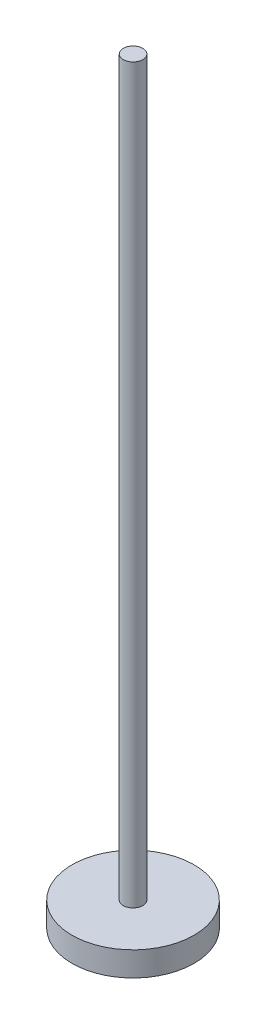
ISO-10303-21;
HEADER;
FILE_DESCRIPTION(('STEP AP214'),'2;1');
FILE_NAME('part.step','',(''),(''),'','','');
FILE_SCHEMA(('AUTOMOTIVE_DESIGN { 1 0 10303 214 1 1 1 1 }'));
ENDSEC;
DATA;
#1=APPLICATION_CONTEXT('core data for automotive mechanical design processes');
#2=APPLICATION_PROTOCOL_DEFINITION('international standard','automotive_design',2000,#1);
#3=PRODUCT_CONTEXT('',#1,'mechanical');
#4=PRODUCT('Part','Part','',(#3));
#5=PRODUCT_RELATED_PRODUCT_CATEGORY('part','',(#4));
#6=PRODUCT_DEFINITION_FORMATION('','',#4);
#7=PRODUCT_DEFINITION_CONTEXT('part definition',#1,'design');
#8=PRODUCT_DEFINITION('design','',#6,#7);
#9=PRODUCT_DEFINITION_SHAPE('','',#8);
#10=(LENGTH_UNIT() NAMED_UNIT(*) SI_UNIT(.MILLI.,.METRE.));
#11=(NAMED_UNIT(*) PLANE_ANGLE_UNIT() SI_UNIT($,.RADIAN.));
#12=(NAMED_UNIT(*) SI_UNIT($,.STERADIAN.) SOLID_ANGLE_UNIT());
#13=UNCERTAINTY_MEASURE_WITH_UNIT(LENGTH_MEASURE(1.E-05),#10,'distance_accuracy_value','');
#14=(GEOMETRIC_REPRESENTATION_CONTEXT(3) GLOBAL_UNCERTAINTY_ASSIGNED_CONTEXT((#13)) GLOBAL_UNIT_ASSIGNED_CONTEXT((#10,
#11,#12)) REPRESENTATION_CONTEXT('',''));
#15=CARTESIAN_POINT('',(0.,0.,0.));
#16=DIRECTION('',(0.,0.,1.));
#17=DIRECTION('',(1.,0.,0.));
#18=AXIS2_PLACEMENT_3D('',#15,#16,#17);
#19=CARTESIAN_POINT('',(4.00000000000568,300.,0.));
#20=DIRECTION('',(0.,1.,0.));
#21=DIRECTION('',(-1.,0.,0.));
#22=AXIS2_PLACEMENT_3D('',#19,#20,#21);
#23=PLANE('',#22);
#24=CARTESIAN_POINT('',(-1.02907469966573E-12,300.,0.));
#25=DIRECTION('',(0.,-1.,0.));
#26=DIRECTION('',(1.,0.,0.));
#27=AXIS2_PLACEMENT_3D('',#24,#25,#26);
#28=CIRCLE('',#27,4.00000000000671);
#29=CARTESIAN_POINT('',(4.00000000000568,300.,0.));
#30=VERTEX_POINT('',#29);
#31=EDGE_CURVE('E10',#30,#30,#28,.T.);
#32=ORIENTED_EDGE('',*,*,#31,.F.);
#33=EDGE_LOOP('',(#32));
#34=FACE_BOUND('',#33,.T.);
#35=ADVANCED_FACE('F39',(#34),#23,.T.);
#36=CARTESIAN_POINT('',(5.67706394844786E-12,-1655.00054086217,0.));
#37=DIRECTION('',(0.,-1.,0.));
#38=DIRECTION('',(1.,0.,0.));
#39=AXIS2_PLACEMENT_3D('',#36,#37,#38);
#40=CYLINDRICAL_SURFACE('',#39,4.00000000000319);
#41=ORIENTED_EDGE('',*,*,#31,.T.);
#42=EDGE_LOOP('',(#41));
#43=FACE_BOUND('',#42,.T.);
#44=CARTESIAN_POINT('',(0.,0.,0.));
#45=DIRECTION('',(0.,-1.,0.));
#46=DIRECTION('',(1.,0.,0.));
#47=AXIS2_PLACEMENT_3D('',#44,#45,#46);
#48=CIRCLE('',#47,3.99999999999967);
#49=CARTESIAN_POINT('',(3.99999999999967,0.,0.));
#50=VERTEX_POINT('',#49);
#51=EDGE_CURVE('E45',#50,#50,#48,.T.);
#52=ORIENTED_EDGE('',*,*,#51,.F.);
#53=EDGE_LOOP('',(#52));
#54=FACE_BOUND('',#53,.T.);
#55=ADVANCED_FACE('F71',(#43,#54),#40,.T.);
#56=CARTESIAN_POINT('',(3.99999999999967,0.,0.));
#57=DIRECTION('',(0.,1.,0.));
#58=DIRECTION('',(-1.,0.,0.));
#59=AXIS2_PLACEMENT_3D('',#56,#57,#58);
#60=PLANE('',#59);
#61=ORIENTED_EDGE('',*,*,#51,.T.);
#62=EDGE_LOOP('',(#61));
#63=FACE_BOUND('',#62,.T.);
#64=CARTESIAN_POINT('',(0.,0.,0.));
#65=DIRECTION('',(0.,-1.,0.));
#66=DIRECTION('',(1.,0.,0.));
#67=AXIS2_PLACEMENT_3D('',#64,#65,#66);
#68=CIRCLE('',#67,25.);
#69=CARTESIAN_POINT('',(25.,0.,0.));
#70=VERTEX_POINT('',#69);
#71=EDGE_CURVE('E49',#70,#70,#68,.T.);
#72=ORIENTED_EDGE('',*,*,#71,.F.);
#73=EDGE_LOOP('',(#72));
#74=FACE_BOUND('',#73,.T.);
#75=ADVANCED_FACE('F63',(#63,#74),#60,.T.);
#76=CARTESIAN_POINT('',(5.67706394844786E-12,-1655.00054086217,0.));
#77=DIRECTION('',(0.,-1.,0.));
#78=DIRECTION('',(1.,0.,0.));
#79=AXIS2_PLACEMENT_3D('',#76,#77,#78);
#80=CYLINDRICAL_SURFACE('',#79,25.);
#81=ORIENTED_EDGE('',*,*,#71,.T.);
#82=EDGE_LOOP('',(#81));
#83=FACE_BOUND('',#82,.T.);
#84=CARTESIAN_POINT('',(0.,-10.,0.));
#85=DIRECTION('',(0.,-1.,0.));
#86=DIRECTION('',(1.,0.,0.));
#87=AXIS2_PLACEMENT_3D('',#84,#85,#86);
#88=CIRCLE('',#87,25.);
#89=CARTESIAN_POINT('',(25.,-9.99999999999992,0.));
#90=VERTEX_POINT('',#89);
#91=EDGE_CURVE('E53',#90,#90,#88,.T.);
#92=ORIENTED_EDGE('',*,*,#91,.F.);
#93=EDGE_LOOP('',(#92));
#94=FACE_BOUND('',#93,.T.);
#95=ADVANCED_FACE('F61',(#83,#94),#80,.T.);
#96=CARTESIAN_POINT('',(25.,-9.99999999999996,0.));
#97=DIRECTION('',(0.,-1.,0.));
#98=DIRECTION('',(1.,0.,0.));
#99=AXIS2_PLACEMENT_3D('',#96,#97,#98);
#100=PLANE('',#99);
#101=ORIENTED_EDGE('',*,*,#91,.T.);
#102=EDGE_LOOP('',(#101));
#103=FACE_BOUND('',#102,.T.);
#104=ADVANCED_FACE('F59',(#103),#100,.T.);
#105=CLOSED_SHELL('',(#35,#55,#75,#95,#104));
#106=MANIFOLD_SOLID_BREP('B2',#105);
#107=ADVANCED_BREP_SHAPE_REPRESENTATION('',(#18,#106),#14);
#108=SHAPE_DEFINITION_REPRESENTATION(#9,#107);
ENDSEC;
END-ISO-10303-21;
